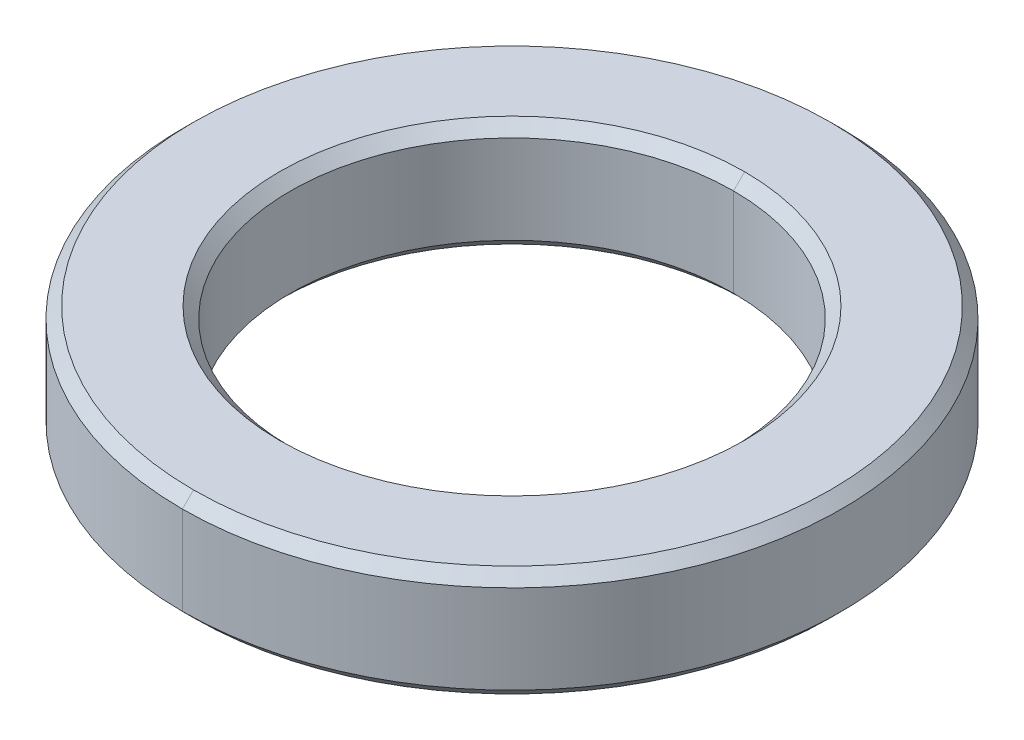
ISO-10303-21;
HEADER;
FILE_DESCRIPTION(('STEP AP214'),'2;1');
FILE_NAME('part.step','',(''),(''),'','','');
FILE_SCHEMA(('AUTOMOTIVE_DESIGN { 1 0 10303 214 1 1 1 1 }'));
ENDSEC;
DATA;
#1=APPLICATION_CONTEXT('core data for automotive mechanical design processes');
#2=APPLICATION_PROTOCOL_DEFINITION('international standard','automotive_design',2000,#1);
#3=PRODUCT_CONTEXT('',#1,'mechanical');
#4=PRODUCT('Part','Part','',(#3));
#5=PRODUCT_RELATED_PRODUCT_CATEGORY('part','',(#4));
#6=PRODUCT_DEFINITION_FORMATION('','',#4);
#7=PRODUCT_DEFINITION_CONTEXT('part definition',#1,'design');
#8=PRODUCT_DEFINITION('design','',#6,#7);
#9=PRODUCT_DEFINITION_SHAPE('','',#8);
#10=(LENGTH_UNIT() NAMED_UNIT(*) SI_UNIT(.MILLI.,.METRE.));
#11=(NAMED_UNIT(*) PLANE_ANGLE_UNIT() SI_UNIT($,.RADIAN.));
#12=(NAMED_UNIT(*) SI_UNIT($,.STERADIAN.) SOLID_ANGLE_UNIT());
#13=UNCERTAINTY_MEASURE_WITH_UNIT(LENGTH_MEASURE(1.E-05),#10,'distance_accuracy_value','');
#14=(GEOMETRIC_REPRESENTATION_CONTEXT(3) GLOBAL_UNCERTAINTY_ASSIGNED_CONTEXT((#13)) GLOBAL_UNIT_ASSIGNED_CONTEXT((#10,
#11,#12)) REPRESENTATION_CONTEXT('',''));
#15=CARTESIAN_POINT('',(0.,0.,0.));
#16=DIRECTION('',(0.,0.,1.));
#17=DIRECTION('',(1.,0.,0.));
#18=AXIS2_PLACEMENT_3D('',#15,#16,#17);
#19=CARTESIAN_POINT('',(0.,0.4,0.));
#20=DIRECTION('',(0.,1.,0.));
#21=DIRECTION('',(0.,0.,1.));
#22=AXIS2_PLACEMENT_3D('',#19,#20,#21);
#23=CONICAL_SURFACE('',#22,2.,0.785398163397452);
#24=DIRECTION('',(0.,0.707106781186545,-0.707106781186551));
#25=VECTOR('',#24,1.);
#26=CARTESIAN_POINT('',(0.,0.4,-2.));
#27=LINE('',#26,#25);
#28=CARTESIAN_POINT('',(0.,0.4,-2.));
#29=VERTEX_POINT('',#28);
#30=CARTESIAN_POINT('',(0.,0.5,-2.1));
#31=VERTEX_POINT('',#30);
#32=EDGE_CURVE('E139',#29,#31,#27,.T.);
#33=ORIENTED_EDGE('',*,*,#32,.F.);
#34=CARTESIAN_POINT('',(0.,0.4,0.));
#35=DIRECTION('',(0.,1.,0.));
#36=DIRECTION('',(0.,0.,1.));
#37=AXIS2_PLACEMENT_3D('',#34,#35,#36);
#38=CIRCLE('',#37,2.);
#39=CARTESIAN_POINT('',(0.,0.4,2.));
#40=VERTEX_POINT('',#39);
#41=EDGE_CURVE('E26',#40,#29,#38,.T.);
#42=ORIENTED_EDGE('',*,*,#41,.F.);
#43=DIRECTION('',(0.,0.707106781186545,0.707106781186551));
#44=VECTOR('',#43,1.);
#45=CARTESIAN_POINT('',(0.,0.4,2.));
#46=LINE('',#45,#44);
#47=CARTESIAN_POINT('',(0.,0.5,2.1));
#48=VERTEX_POINT('',#47);
#49=EDGE_CURVE('E131',#40,#48,#46,.T.);
#50=ORIENTED_EDGE('',*,*,#49,.T.);
#51=CARTESIAN_POINT('',(0.,0.5,0.));
#52=DIRECTION('',(0.,-1.,0.));
#53=DIRECTION('',(0.,0.,1.));
#54=AXIS2_PLACEMENT_3D('',#51,#52,#53);
#55=CIRCLE('',#54,2.1);
#56=EDGE_CURVE('E121',#31,#48,#55,.T.);
#57=ORIENTED_EDGE('',*,*,#56,.F.);
#58=EDGE_LOOP('',(#33,#42,#50,#57));
#59=FACE_BOUND('',#58,.T.);
#60=ADVANCED_FACE('F15',(#59),#23,.F.);
#61=CARTESIAN_POINT('',(0.,-0.5,0.));
#62=DIRECTION('',(0.,-1.,0.));
#63=DIRECTION('',(0.,0.,-1.));
#64=AXIS2_PLACEMENT_3D('',#61,#62,#63);
#65=CONICAL_SURFACE('',#64,2.1,0.785398163397443);
#66=DIRECTION('',(0.,-0.707106781186551,0.707106781186545));
#67=VECTOR('',#66,1.);
#68=CARTESIAN_POINT('',(0.,-0.5,2.1));
#69=LINE('',#68,#67);
#70=CARTESIAN_POINT('',(0.,-0.4,2.));
#71=VERTEX_POINT('',#70);
#72=CARTESIAN_POINT('',(0.,-0.5,2.1));
#73=VERTEX_POINT('',#72);
#74=EDGE_CURVE('E161',#71,#73,#69,.T.);
#75=ORIENTED_EDGE('',*,*,#74,.F.);
#76=CARTESIAN_POINT('',(0.,-0.4,0.));
#77=DIRECTION('',(0.,-1.,0.));
#78=DIRECTION('',(0.,0.,1.));
#79=AXIS2_PLACEMENT_3D('',#76,#77,#78);
#80=CIRCLE('',#79,2.);
#81=CARTESIAN_POINT('',(0.,-0.4,-2.));
#82=VERTEX_POINT('',#81);
#83=EDGE_CURVE('E10',#82,#71,#80,.T.);
#84=ORIENTED_EDGE('',*,*,#83,.F.);
#85=DIRECTION('',(0.,-0.707106781186551,-0.707106781186545));
#86=VECTOR('',#85,1.);
#87=CARTESIAN_POINT('',(0.,-0.5,-2.1));
#88=LINE('',#87,#86);
#89=CARTESIAN_POINT('',(0.,-0.5,-2.1));
#90=VERTEX_POINT('',#89);
#91=EDGE_CURVE('E160',#82,#90,#88,.T.);
#92=ORIENTED_EDGE('',*,*,#91,.T.);
#93=CARTESIAN_POINT('',(0.,-0.5,0.));
#94=DIRECTION('',(0.,1.,0.));
#95=DIRECTION('',(0.,0.,1.));
#96=AXIS2_PLACEMENT_3D('',#93,#94,#95);
#97=CIRCLE('',#96,2.1);
#98=EDGE_CURVE('E180',#73,#90,#97,.T.);
#99=ORIENTED_EDGE('',*,*,#98,.F.);
#100=EDGE_LOOP('',(#75,#84,#92,#99));
#101=FACE_BOUND('',#100,.T.);
#102=ADVANCED_FACE('F245',(#101),#65,.F.);
#103=CARTESIAN_POINT('',(0.,0.5,0.));
#104=DIRECTION('',(0.,-1.,0.));
#105=DIRECTION('',(0.,0.,-1.));
#106=AXIS2_PLACEMENT_3D('',#103,#104,#105);
#107=CONICAL_SURFACE('',#106,2.875,0.785398163397448);
#108=DIRECTION('',(0.,-0.707106781186548,0.707106781186548));
#109=VECTOR('',#108,1.);
#110=CARTESIAN_POINT('',(0.,0.5,2.875));
#111=LINE('',#110,#109);
#112=CARTESIAN_POINT('',(0.,0.5,2.875));
#113=VERTEX_POINT('',#112);
#114=CARTESIAN_POINT('',(0.,0.4,2.975));
#115=VERTEX_POINT('',#114);
#116=EDGE_CURVE('E162',#113,#115,#111,.T.);
#117=ORIENTED_EDGE('',*,*,#116,.F.);
#118=CARTESIAN_POINT('',(0.,0.5,0.));
#119=DIRECTION('',(0.,1.,0.));
#120=DIRECTION('',(0.,0.,1.));
#121=AXIS2_PLACEMENT_3D('',#118,#119,#120);
#122=CIRCLE('',#121,2.875);
#123=CARTESIAN_POINT('',(0.,0.5,-2.875));
#124=VERTEX_POINT('',#123);
#125=EDGE_CURVE('E128',#124,#113,#122,.T.);
#126=ORIENTED_EDGE('',*,*,#125,.F.);
#127=DIRECTION('',(0.,-0.707106781186548,-0.707106781186548));
#128=VECTOR('',#127,1.);
#129=CARTESIAN_POINT('',(0.,0.5,-2.875));
#130=LINE('',#129,#128);
#131=CARTESIAN_POINT('',(0.,0.4,-2.975));
#132=VERTEX_POINT('',#131);
#133=EDGE_CURVE('E173',#124,#132,#130,.T.);
#134=ORIENTED_EDGE('',*,*,#133,.T.);
#135=CARTESIAN_POINT('',(0.,0.4,0.));
#136=DIRECTION('',(0.,-1.,0.));
#137=DIRECTION('',(0.,0.,1.));
#138=AXIS2_PLACEMENT_3D('',#135,#136,#137);
#139=CIRCLE('',#138,2.975);
#140=EDGE_CURVE('E19',#115,#132,#139,.T.);
#141=ORIENTED_EDGE('',*,*,#140,.F.);
#142=EDGE_LOOP('',(#117,#126,#134,#141));
#143=FACE_BOUND('',#142,.T.);
#144=ADVANCED_FACE('F250',(#143),#107,.T.);
#145=CARTESIAN_POINT('',(0.,-0.4,0.));
#146=DIRECTION('',(0.,1.,0.));
#147=DIRECTION('',(0.,0.,1.));
#148=AXIS2_PLACEMENT_3D('',#145,#146,#147);
#149=CONICAL_SURFACE('',#148,2.975,0.785398163397446);
#150=DIRECTION('',(0.,0.707106781186549,-0.707106781186546));
#151=VECTOR('',#150,1.);
#152=CARTESIAN_POINT('',(0.,-0.4,-2.975));
#153=LINE('',#152,#151);
#154=CARTESIAN_POINT('',(0.,-0.5,-2.875));
#155=VERTEX_POINT('',#154);
#156=CARTESIAN_POINT('',(0.,-0.4,-2.975));
#157=VERTEX_POINT('',#156);
#158=EDGE_CURVE('E168',#155,#157,#153,.T.);
#159=ORIENTED_EDGE('',*,*,#158,.F.);
#160=CARTESIAN_POINT('',(0.,-0.5,0.));
#161=DIRECTION('',(0.,-1.,0.));
#162=DIRECTION('',(0.,0.,1.));
#163=AXIS2_PLACEMENT_3D('',#160,#161,#162);
#164=CIRCLE('',#163,2.875);
#165=CARTESIAN_POINT('',(0.,-0.5,2.875));
#166=VERTEX_POINT('',#165);
#167=EDGE_CURVE('E63',#166,#155,#164,.T.);
#168=ORIENTED_EDGE('',*,*,#167,.F.);
#169=DIRECTION('',(0.,0.707106781186549,0.707106781186546));
#170=VECTOR('',#169,1.);
#171=CARTESIAN_POINT('',(0.,-0.4,2.975));
#172=LINE('',#171,#170);
#173=CARTESIAN_POINT('',(0.,-0.4,2.975));
#174=VERTEX_POINT('',#173);
#175=EDGE_CURVE('E150',#166,#174,#172,.T.);
#176=ORIENTED_EDGE('',*,*,#175,.T.);
#177=CARTESIAN_POINT('',(0.,-0.4,0.));
#178=DIRECTION('',(0.,1.,0.));
#179=DIRECTION('',(0.,0.,1.));
#180=AXIS2_PLACEMENT_3D('',#177,#178,#179);
#181=CIRCLE('',#180,2.975);
#182=EDGE_CURVE('E41',#157,#174,#181,.T.);
#183=ORIENTED_EDGE('',*,*,#182,.F.);
#184=EDGE_LOOP('',(#159,#168,#176,#183));
#185=FACE_BOUND('',#184,.T.);
#186=ADVANCED_FACE('F228',(#185),#149,.T.);
#187=CARTESIAN_POINT('',(0.,0.5,0.));
#188=DIRECTION('',(0.,-1.,0.));
#189=DIRECTION('',(0.,0.,-1.));
#190=AXIS2_PLACEMENT_3D('',#187,#188,#189);
#191=CYLINDRICAL_SURFACE('',#190,2.);
#192=DIRECTION('',(0.,-1.,0.));
#193=VECTOR('',#192,1.);
#194=CARTESIAN_POINT('',(0.,0.5,2.));
#195=LINE('',#194,#193);
#196=EDGE_CURVE('E154',#40,#71,#195,.T.);
#197=ORIENTED_EDGE('',*,*,#196,.F.);
#198=ORIENTED_EDGE('',*,*,#41,.T.);
#199=DIRECTION('',(0.,-1.,0.));
#200=VECTOR('',#199,1.);
#201=CARTESIAN_POINT('',(0.,0.5,-2.));
#202=LINE('',#201,#200);
#203=EDGE_CURVE('E193',#29,#82,#202,.T.);
#204=ORIENTED_EDGE('',*,*,#203,.T.);
#205=ORIENTED_EDGE('',*,*,#83,.T.);
#206=EDGE_LOOP('',(#197,#198,#204,#205));
#207=FACE_BOUND('',#206,.T.);
#208=ADVANCED_FACE('F232',(#207),#191,.F.);
#209=CARTESIAN_POINT('',(0.,0.5,0.));
#210=DIRECTION('',(0.,-1.,0.));
#211=DIRECTION('',(0.,0.,-1.));
#212=AXIS2_PLACEMENT_3D('',#209,#210,#211);
#213=CYLINDRICAL_SURFACE('',#212,2.975);
#214=DIRECTION('',(0.,-1.,0.));
#215=VECTOR('',#214,1.);
#216=CARTESIAN_POINT('',(0.,0.5,2.975));
#217=LINE('',#216,#215);
#218=EDGE_CURVE('E197',#115,#174,#217,.T.);
#219=ORIENTED_EDGE('',*,*,#218,.F.);
#220=ORIENTED_EDGE('',*,*,#140,.T.);
#221=DIRECTION('',(0.,-1.,0.));
#222=VECTOR('',#221,1.);
#223=CARTESIAN_POINT('',(0.,0.5,-2.975));
#224=LINE('',#223,#222);
#225=EDGE_CURVE('E194',#132,#157,#224,.T.);
#226=ORIENTED_EDGE('',*,*,#225,.T.);
#227=ORIENTED_EDGE('',*,*,#182,.T.);
#228=EDGE_LOOP('',(#219,#220,#226,#227));
#229=FACE_BOUND('',#228,.T.);
#230=ADVANCED_FACE('F229',(#229),#213,.T.);
#231=CARTESIAN_POINT('',(0.,-0.5,0.));
#232=DIRECTION('',(0.,1.,0.));
#233=DIRECTION('',(1.,0.,0.));
#234=AXIS2_PLACEMENT_3D('',#231,#232,#233);
#235=PLANE('',#234);
#236=CARTESIAN_POINT('',(0.,-0.5,0.));
#237=DIRECTION('',(0.,1.,0.));
#238=DIRECTION('',(0.,0.,1.));
#239=AXIS2_PLACEMENT_3D('',#236,#237,#238);
#240=CIRCLE('',#239,2.1);
#241=EDGE_CURVE('E156',#90,#73,#240,.T.);
#242=ORIENTED_EDGE('',*,*,#241,.T.);
#243=ORIENTED_EDGE('',*,*,#98,.T.);
#244=EDGE_LOOP('',(#242,#243));
#245=FACE_BOUND('',#244,.T.);
#246=ORIENTED_EDGE('',*,*,#167,.T.);
#247=CARTESIAN_POINT('',(0.,-0.5,0.));
#248=DIRECTION('',(0.,-1.,0.));
#249=DIRECTION('',(0.,0.,1.));
#250=AXIS2_PLACEMENT_3D('',#247,#248,#249);
#251=CIRCLE('',#250,2.875);
#252=EDGE_CURVE('E172',#155,#166,#251,.T.);
#253=ORIENTED_EDGE('',*,*,#252,.T.);
#254=EDGE_LOOP('',(#246,#253));
#255=FACE_BOUND('',#254,.T.);
#256=ADVANCED_FACE('F231',(#245,#255),#235,.F.);
#257=CARTESIAN_POINT('',(0.,0.5,0.));
#258=DIRECTION('',(0.,1.,0.));
#259=DIRECTION('',(1.,0.,0.));
#260=AXIS2_PLACEMENT_3D('',#257,#258,#259);
#261=PLANE('',#260);
#262=CARTESIAN_POINT('',(0.,0.5,0.));
#263=DIRECTION('',(0.,-1.,0.));
#264=DIRECTION('',(0.,0.,1.));
#265=AXIS2_PLACEMENT_3D('',#262,#263,#264);
#266=CIRCLE('',#265,2.1);
#267=EDGE_CURVE('E125',#48,#31,#266,.T.);
#268=ORIENTED_EDGE('',*,*,#267,.T.);
#269=ORIENTED_EDGE('',*,*,#56,.T.);
#270=EDGE_LOOP('',(#268,#269));
#271=FACE_BOUND('',#270,.T.);
#272=ORIENTED_EDGE('',*,*,#125,.T.);
#273=CARTESIAN_POINT('',(0.,0.5,0.));
#274=DIRECTION('',(0.,1.,0.));
#275=DIRECTION('',(0.,0.,1.));
#276=AXIS2_PLACEMENT_3D('',#273,#274,#275);
#277=CIRCLE('',#276,2.875);
#278=EDGE_CURVE('E167',#113,#124,#277,.T.);
#279=ORIENTED_EDGE('',*,*,#278,.T.);
#280=EDGE_LOOP('',(#272,#279));
#281=FACE_BOUND('',#280,.T.);
#282=ADVANCED_FACE('F122',(#271,#281),#261,.T.);
#283=CARTESIAN_POINT('',(0.,0.5,0.));
#284=DIRECTION('',(0.,-1.,0.));
#285=DIRECTION('',(0.,0.,-1.));
#286=AXIS2_PLACEMENT_3D('',#283,#284,#285);
#287=CYLINDRICAL_SURFACE('',#286,2.975);
#288=CARTESIAN_POINT('',(0.,0.4,0.));
#289=DIRECTION('',(0.,-1.,0.));
#290=DIRECTION('',(0.,0.,1.));
#291=AXIS2_PLACEMENT_3D('',#288,#289,#290);
#292=CIRCLE('',#291,2.975);
#293=EDGE_CURVE('E166',#132,#115,#292,.T.);
#294=ORIENTED_EDGE('',*,*,#293,.T.);
#295=ORIENTED_EDGE('',*,*,#218,.T.);
#296=CARTESIAN_POINT('',(0.,-0.4,0.));
#297=DIRECTION('',(0.,1.,0.));
#298=DIRECTION('',(0.,0.,1.));
#299=AXIS2_PLACEMENT_3D('',#296,#297,#298);
#300=CIRCLE('',#299,2.975);
#301=EDGE_CURVE('E155',#174,#157,#300,.T.);
#302=ORIENTED_EDGE('',*,*,#301,.T.);
#303=ORIENTED_EDGE('',*,*,#225,.F.);
#304=EDGE_LOOP('',(#294,#295,#302,#303));
#305=FACE_BOUND('',#304,.T.);
#306=ADVANCED_FACE('F222',(#305),#287,.T.);
#307=CARTESIAN_POINT('',(0.,0.5,0.));
#308=DIRECTION('',(0.,-1.,0.));
#309=DIRECTION('',(0.,0.,-1.));
#310=AXIS2_PLACEMENT_3D('',#307,#308,#309);
#311=CYLINDRICAL_SURFACE('',#310,2.);
#312=CARTESIAN_POINT('',(0.,0.4,0.));
#313=DIRECTION('',(0.,1.,0.));
#314=DIRECTION('',(0.,0.,1.));
#315=AXIS2_PLACEMENT_3D('',#312,#313,#314);
#316=CIRCLE('',#315,2.);
#317=EDGE_CURVE('E146',#29,#40,#316,.T.);
#318=ORIENTED_EDGE('',*,*,#317,.T.);
#319=ORIENTED_EDGE('',*,*,#196,.T.);
#320=CARTESIAN_POINT('',(0.,-0.4,0.));
#321=DIRECTION('',(0.,-1.,0.));
#322=DIRECTION('',(0.,0.,1.));
#323=AXIS2_PLACEMENT_3D('',#320,#321,#322);
#324=CIRCLE('',#323,2.);
#325=EDGE_CURVE('E136',#71,#82,#324,.T.);
#326=ORIENTED_EDGE('',*,*,#325,.T.);
#327=ORIENTED_EDGE('',*,*,#203,.F.);
#328=EDGE_LOOP('',(#318,#319,#326,#327));
#329=FACE_BOUND('',#328,.T.);
#330=ADVANCED_FACE('F17',(#329),#311,.F.);
#331=CARTESIAN_POINT('',(0.,-0.4,0.));
#332=DIRECTION('',(0.,1.,0.));
#333=DIRECTION('',(0.,0.,1.));
#334=AXIS2_PLACEMENT_3D('',#331,#332,#333);
#335=CONICAL_SURFACE('',#334,2.975,0.785398163397446);
#336=ORIENTED_EDGE('',*,*,#252,.F.);
#337=ORIENTED_EDGE('',*,*,#158,.T.);
#338=ORIENTED_EDGE('',*,*,#301,.F.);
#339=ORIENTED_EDGE('',*,*,#175,.F.);
#340=EDGE_LOOP('',(#336,#337,#338,#339));
#341=FACE_BOUND('',#340,.T.);
#342=ADVANCED_FACE('F226',(#341),#335,.T.);
#343=CARTESIAN_POINT('',(0.,0.5,0.));
#344=DIRECTION('',(0.,-1.,0.));
#345=DIRECTION('',(0.,0.,-1.));
#346=AXIS2_PLACEMENT_3D('',#343,#344,#345);
#347=CONICAL_SURFACE('',#346,2.875,0.785398163397448);
#348=ORIENTED_EDGE('',*,*,#278,.F.);
#349=ORIENTED_EDGE('',*,*,#116,.T.);
#350=ORIENTED_EDGE('',*,*,#293,.F.);
#351=ORIENTED_EDGE('',*,*,#133,.F.);
#352=EDGE_LOOP('',(#348,#349,#350,#351));
#353=FACE_BOUND('',#352,.T.);
#354=ADVANCED_FACE('F255',(#353),#347,.T.);
#355=CARTESIAN_POINT('',(0.,-0.5,0.));
#356=DIRECTION('',(0.,-1.,0.));
#357=DIRECTION('',(0.,0.,-1.));
#358=AXIS2_PLACEMENT_3D('',#355,#356,#357);
#359=CONICAL_SURFACE('',#358,2.1,0.785398163397443);
#360=ORIENTED_EDGE('',*,*,#325,.F.);
#361=ORIENTED_EDGE('',*,*,#74,.T.);
#362=ORIENTED_EDGE('',*,*,#241,.F.);
#363=ORIENTED_EDGE('',*,*,#91,.F.);
#364=EDGE_LOOP('',(#360,#361,#362,#363));
#365=FACE_BOUND('',#364,.T.);
#366=ADVANCED_FACE('F260',(#365),#359,.F.);
#367=CARTESIAN_POINT('',(0.,0.4,0.));
#368=DIRECTION('',(0.,1.,0.));
#369=DIRECTION('',(0.,0.,1.));
#370=AXIS2_PLACEMENT_3D('',#367,#368,#369);
#371=CONICAL_SURFACE('',#370,2.,0.785398163397452);
#372=ORIENTED_EDGE('',*,*,#317,.F.);
#373=ORIENTED_EDGE('',*,*,#32,.T.);
#374=ORIENTED_EDGE('',*,*,#267,.F.);
#375=ORIENTED_EDGE('',*,*,#49,.F.);
#376=EDGE_LOOP('',(#372,#373,#374,#375));
#377=FACE_BOUND('',#376,.T.);
#378=ADVANCED_FACE('F138',(#377),#371,.F.);
#379=CLOSED_SHELL('',(#60,#102,#144,#186,#208,#230,#256,#282,#306,#330,#342,#354,#366,#378));
#380=MANIFOLD_SOLID_BREP('B1',#379);
#381=ADVANCED_BREP_SHAPE_REPRESENTATION('',(#18,#380),#14);
#382=SHAPE_DEFINITION_REPRESENTATION(#9,#381);
ENDSEC;
END-ISO-10303-21;
